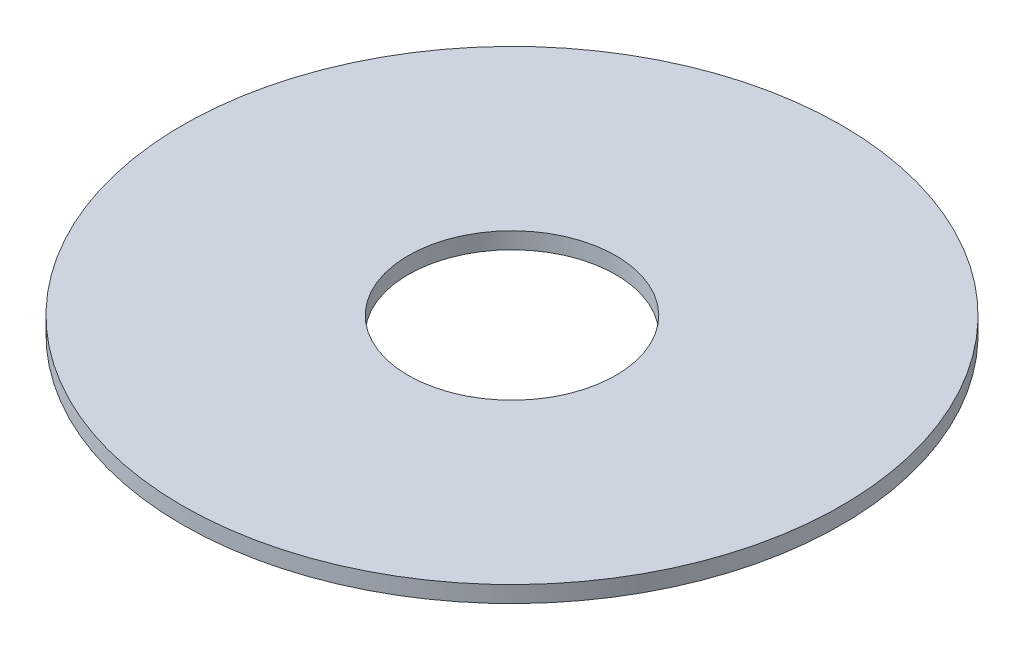
ISO-10303-21;
HEADER;
FILE_DESCRIPTION(('STEP AP214'),'2;1');
FILE_NAME('part.step','',(''),(''),'','','');
FILE_SCHEMA(('AUTOMOTIVE_DESIGN { 1 0 10303 214 1 1 1 1 }'));
ENDSEC;
DATA;
#1=APPLICATION_CONTEXT('core data for automotive mechanical design processes');
#2=APPLICATION_PROTOCOL_DEFINITION('international standard','automotive_design',2000,#1);
#3=PRODUCT_CONTEXT('',#1,'mechanical');
#4=PRODUCT('Part','Part','',(#3));
#5=PRODUCT_RELATED_PRODUCT_CATEGORY('part','',(#4));
#6=PRODUCT_DEFINITION_FORMATION('','',#4);
#7=PRODUCT_DEFINITION_CONTEXT('part definition',#1,'design');
#8=PRODUCT_DEFINITION('design','',#6,#7);
#9=PRODUCT_DEFINITION_SHAPE('','',#8);
#10=(LENGTH_UNIT() NAMED_UNIT(*) SI_UNIT(.MILLI.,.METRE.));
#11=(NAMED_UNIT(*) PLANE_ANGLE_UNIT() SI_UNIT($,.RADIAN.));
#12=(NAMED_UNIT(*) SI_UNIT($,.STERADIAN.) SOLID_ANGLE_UNIT());
#13=UNCERTAINTY_MEASURE_WITH_UNIT(LENGTH_MEASURE(1.E-05),#10,'distance_accuracy_value','');
#14=(GEOMETRIC_REPRESENTATION_CONTEXT(3) GLOBAL_UNCERTAINTY_ASSIGNED_CONTEXT((#13)) GLOBAL_UNIT_ASSIGNED_CONTEXT((#10,
#11,#12)) REPRESENTATION_CONTEXT('',''));
#15=CARTESIAN_POINT('',(0.,0.,0.));
#16=DIRECTION('',(0.,0.,1.));
#17=DIRECTION('',(1.,0.,0.));
#18=AXIS2_PLACEMENT_3D('',#15,#16,#17);
#19=CARTESIAN_POINT('',(0.,5.,0.));
#20=DIRECTION('',(0.,1.,0.));
#21=DIRECTION('',(0.,0.,1.));
#22=AXIS2_PLACEMENT_3D('',#19,#20,#21);
#23=PLANE('',#22);
#24=CARTESIAN_POINT('',(0.,5.,0.));
#25=DIRECTION('',(0.,1.,0.));
#26=DIRECTION('',(0.,0.,1.));
#27=AXIS2_PLACEMENT_3D('',#24,#25,#26);
#28=CIRCLE('',#27,100.);
#29=CARTESIAN_POINT('',(0.,5.,100.));
#30=VERTEX_POINT('',#29);
#31=EDGE_CURVE('E10',#30,#30,#28,.T.);
#32=ORIENTED_EDGE('',*,*,#31,.T.);
#33=EDGE_LOOP('',(#32));
#34=FACE_BOUND('',#33,.T.);
#35=CARTESIAN_POINT('',(0.,5.,0.));
#36=DIRECTION('',(0.,1.,0.));
#37=DIRECTION('',(0.,0.,1.));
#38=AXIS2_PLACEMENT_3D('',#35,#36,#37);
#39=CIRCLE('',#38,31.5);
#40=CARTESIAN_POINT('',(0.,5.,31.5));
#41=VERTEX_POINT('',#40);
#42=EDGE_CURVE('E50',#41,#41,#39,.T.);
#43=ORIENTED_EDGE('',*,*,#42,.F.);
#44=EDGE_LOOP('',(#43));
#45=FACE_BOUND('',#44,.T.);
#46=ADVANCED_FACE('F37',(#34,#45),#23,.T.);
#47=CARTESIAN_POINT('',(0.,0.,0.));
#48=DIRECTION('',(0.,1.,0.));
#49=DIRECTION('',(0.,0.,1.));
#50=AXIS2_PLACEMENT_3D('',#47,#48,#49);
#51=PLANE('',#50);
#52=CARTESIAN_POINT('',(0.,0.,0.));
#53=DIRECTION('',(0.,1.,0.));
#54=DIRECTION('',(0.,0.,1.));
#55=AXIS2_PLACEMENT_3D('',#52,#53,#54);
#56=CIRCLE('',#55,100.);
#57=CARTESIAN_POINT('',(0.,0.,100.));
#58=VERTEX_POINT('',#57);
#59=EDGE_CURVE('E41',#58,#58,#56,.T.);
#60=ORIENTED_EDGE('',*,*,#59,.F.);
#61=EDGE_LOOP('',(#60));
#62=FACE_BOUND('',#61,.T.);
#63=CARTESIAN_POINT('',(0.,0.,0.));
#64=DIRECTION('',(0.,1.,0.));
#65=DIRECTION('',(0.,0.,1.));
#66=AXIS2_PLACEMENT_3D('',#63,#64,#65);
#67=CIRCLE('',#66,31.5);
#68=CARTESIAN_POINT('',(0.,0.,31.5));
#69=VERTEX_POINT('',#68);
#70=EDGE_CURVE('E52',#69,#69,#67,.T.);
#71=ORIENTED_EDGE('',*,*,#70,.T.);
#72=EDGE_LOOP('',(#71));
#73=FACE_BOUND('',#72,.T.);
#74=ADVANCED_FACE('F64',(#62,#73),#51,.F.);
#75=CARTESIAN_POINT('',(0.,5.,0.));
#76=DIRECTION('',(0.,-1.,0.));
#77=DIRECTION('',(0.,0.,-1.));
#78=AXIS2_PLACEMENT_3D('',#75,#76,#77);
#79=CYLINDRICAL_SURFACE('',#78,100.);
#80=ORIENTED_EDGE('',*,*,#31,.F.);
#81=EDGE_LOOP('',(#80));
#82=FACE_BOUND('',#81,.T.);
#83=ORIENTED_EDGE('',*,*,#59,.T.);
#84=EDGE_LOOP('',(#83));
#85=FACE_BOUND('',#84,.T.);
#86=ADVANCED_FACE('F39',(#82,#85),#79,.T.);
#87=CARTESIAN_POINT('',(0.,5.,0.));
#88=DIRECTION('',(0.,-1.,0.));
#89=DIRECTION('',(0.,0.,-1.));
#90=AXIS2_PLACEMENT_3D('',#87,#88,#89);
#91=CYLINDRICAL_SURFACE('',#90,31.5);
#92=ORIENTED_EDGE('',*,*,#42,.T.);
#93=EDGE_LOOP('',(#92));
#94=FACE_BOUND('',#93,.T.);
#95=ORIENTED_EDGE('',*,*,#70,.F.);
#96=EDGE_LOOP('',(#95));
#97=FACE_BOUND('',#96,.T.);
#98=ADVANCED_FACE('F60',(#94,#97),#91,.F.);
#99=CLOSED_SHELL('',(#46,#74,#86,#98));
#100=MANIFOLD_SOLID_BREP('B2',#99);
#101=ADVANCED_BREP_SHAPE_REPRESENTATION('',(#18,#100),#14);
#102=SHAPE_DEFINITION_REPRESENTATION(#9,#101);
ENDSEC;
END-ISO-10303-21;
